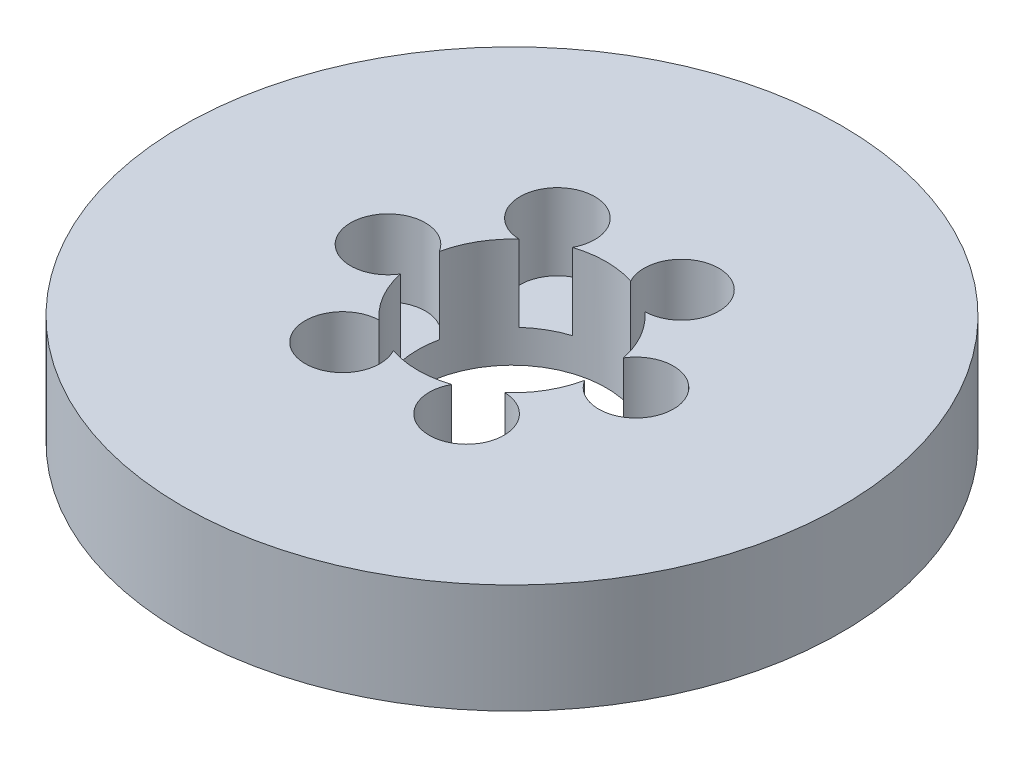
ISO-10303-21;
HEADER;
FILE_DESCRIPTION(('STEP AP214'),'2;1');
FILE_NAME('part.step','',(''),(''),'','','');
FILE_SCHEMA(('AUTOMOTIVE_DESIGN { 1 0 10303 214 1 1 1 1 }'));
ENDSEC;
DATA;
#1=APPLICATION_CONTEXT('core data for automotive mechanical design processes');
#2=APPLICATION_PROTOCOL_DEFINITION('international standard','automotive_design',2000,#1);
#3=PRODUCT_CONTEXT('',#1,'mechanical');
#4=PRODUCT('Part','Part','',(#3));
#5=PRODUCT_RELATED_PRODUCT_CATEGORY('part','',(#4));
#6=PRODUCT_DEFINITION_FORMATION('','',#4);
#7=PRODUCT_DEFINITION_CONTEXT('part definition',#1,'design');
#8=PRODUCT_DEFINITION('design','',#6,#7);
#9=PRODUCT_DEFINITION_SHAPE('','',#8);
#10=(LENGTH_UNIT() NAMED_UNIT(*) SI_UNIT(.MILLI.,.METRE.));
#11=(NAMED_UNIT(*) PLANE_ANGLE_UNIT() SI_UNIT($,.RADIAN.));
#12=(NAMED_UNIT(*) SI_UNIT($,.STERADIAN.) SOLID_ANGLE_UNIT());
#13=UNCERTAINTY_MEASURE_WITH_UNIT(LENGTH_MEASURE(1.E-05),#10,'distance_accuracy_value','');
#14=(GEOMETRIC_REPRESENTATION_CONTEXT(3) GLOBAL_UNCERTAINTY_ASSIGNED_CONTEXT((#13)) GLOBAL_UNIT_ASSIGNED_CONTEXT((#10,
#11,#12)) REPRESENTATION_CONTEXT('',''));
#15=CARTESIAN_POINT('',(0.,0.,0.));
#16=DIRECTION('',(0.,0.,1.));
#17=DIRECTION('',(1.,0.,0.));
#18=AXIS2_PLACEMENT_3D('',#15,#16,#17);
#19=CARTESIAN_POINT('',(0.,29.,0.));
#20=DIRECTION('',(0.,-1.,0.));
#21=DIRECTION('',(0.,0.,-1.));
#22=AXIS2_PLACEMENT_3D('',#19,#20,#21);
#23=CYLINDRICAL_SURFACE('',#22,87.5);
#24=CARTESIAN_POINT('',(0.,29.,0.));
#25=DIRECTION('',(0.,1.,0.));
#26=DIRECTION('',(0.,0.,1.));
#27=AXIS2_PLACEMENT_3D('',#24,#25,#26);
#28=CIRCLE('',#27,87.5);
#29=CARTESIAN_POINT('',(0.,29.,-87.5));
#30=VERTEX_POINT('',#29);
#31=EDGE_CURVE('E171',#30,#30,#28,.T.);
#32=CARTESIAN_POINT('',(0.,0.,0.));
#33=DIRECTION('',(0.,1.,0.));
#34=DIRECTION('',(0.,0.,1.));
#35=AXIS2_PLACEMENT_3D('',#32,#33,#34);
#36=CIRCLE('',#35,87.5);
#37=CARTESIAN_POINT('',(0.,0.,-87.5));
#38=VERTEX_POINT('',#37);
#39=EDGE_CURVE('E157',#38,#38,#36,.T.);
#40=CARTESIAN_POINT('',(0.,29.,-87.5));
#41=CARTESIAN_POINT('',(0.,28.6979166666667,-87.5));
#42=CARTESIAN_POINT('',(0.,28.3958333333333,-87.5));
#43=CARTESIAN_POINT('',(0.,27.7916666666667,-87.5));
#44=CARTESIAN_POINT('',(0.,27.4895833333333,-87.5));
#45=CARTESIAN_POINT('',(0.,26.8854166666667,-87.5));
#46=CARTESIAN_POINT('',(0.,26.5833333333333,-87.5));
#47=CARTESIAN_POINT('',(0.,25.9791666666667,-87.5));
#48=CARTESIAN_POINT('',(0.,25.6770833333333,-87.5));
#49=CARTESIAN_POINT('',(0.,25.0729166666667,-87.5));
#50=CARTESIAN_POINT('',(0.,24.7708333333333,-87.5));
#51=CARTESIAN_POINT('',(0.,24.1666666666667,-87.5));
#52=CARTESIAN_POINT('',(0.,23.8645833333333,-87.5));
#53=CARTESIAN_POINT('',(0.,23.2604166666667,-87.5));
#54=CARTESIAN_POINT('',(0.,22.9583333333333,-87.5));
#55=CARTESIAN_POINT('',(0.,22.3541666666667,-87.5));
#56=CARTESIAN_POINT('',(0.,22.0520833333333,-87.5));
#57=CARTESIAN_POINT('',(0.,21.4479166666667,-87.5));
#58=CARTESIAN_POINT('',(0.,21.1458333333333,-87.5));
#59=CARTESIAN_POINT('',(0.,20.5416666666667,-87.5));
#60=CARTESIAN_POINT('',(0.,20.2395833333333,-87.5));
#61=CARTESIAN_POINT('',(0.,19.6354166666667,-87.5));
#62=CARTESIAN_POINT('',(0.,19.3333333333333,-87.5));
#63=CARTESIAN_POINT('',(0.,18.7291666666667,-87.5));
#64=CARTESIAN_POINT('',(0.,18.4270833333333,-87.5));
#65=CARTESIAN_POINT('',(0.,17.8229166666667,-87.5));
#66=CARTESIAN_POINT('',(0.,17.5208333333333,-87.5));
#67=CARTESIAN_POINT('',(0.,16.9166666666667,-87.5));
#68=CARTESIAN_POINT('',(0.,16.6145833333333,-87.5));
#69=CARTESIAN_POINT('',(0.,16.0104166666667,-87.5));
#70=CARTESIAN_POINT('',(0.,15.7083333333333,-87.5));
#71=CARTESIAN_POINT('',(0.,15.1041666666667,-87.5));
#72=CARTESIAN_POINT('',(0.,14.8020833333333,-87.5));
#73=CARTESIAN_POINT('',(0.,14.1979166666667,-87.5));
#74=CARTESIAN_POINT('',(0.,13.8958333333333,-87.5));
#75=CARTESIAN_POINT('',(0.,13.2916666666667,-87.5));
#76=CARTESIAN_POINT('',(0.,12.9895833333333,-87.5));
#77=CARTESIAN_POINT('',(0.,12.3854166666667,-87.5));
#78=CARTESIAN_POINT('',(0.,12.0833333333333,-87.5));
#79=CARTESIAN_POINT('',(0.,11.4791666666667,-87.5));
#80=CARTESIAN_POINT('',(0.,11.1770833333333,-87.5));
#81=CARTESIAN_POINT('',(0.,10.5729166666667,-87.5));
#82=CARTESIAN_POINT('',(0.,10.2708333333333,-87.5));
#83=CARTESIAN_POINT('',(0.,9.66666666666667,-87.5));
#84=CARTESIAN_POINT('',(0.,9.36458333333333,-87.5));
#85=CARTESIAN_POINT('',(0.,8.76041666666667,-87.5));
#86=CARTESIAN_POINT('',(0.,8.45833333333333,-87.5));
#87=CARTESIAN_POINT('',(0.,7.85416666666667,-87.5));
#88=CARTESIAN_POINT('',(0.,7.55208333333333,-87.5));
#89=CARTESIAN_POINT('',(0.,6.94791666666667,-87.5));
#90=CARTESIAN_POINT('',(0.,6.64583333333333,-87.5));
#91=CARTESIAN_POINT('',(0.,6.04166666666667,-87.5));
#92=CARTESIAN_POINT('',(0.,5.73958333333333,-87.5));
#93=CARTESIAN_POINT('',(0.,5.13541666666667,-87.5));
#94=CARTESIAN_POINT('',(0.,4.83333333333333,-87.5));
#95=CARTESIAN_POINT('',(0.,4.22916666666667,-87.5));
#96=CARTESIAN_POINT('',(0.,3.92708333333333,-87.5));
#97=CARTESIAN_POINT('',(0.,3.32291666666667,-87.5));
#98=CARTESIAN_POINT('',(0.,3.02083333333333,-87.5));
#99=CARTESIAN_POINT('',(0.,2.41666666666667,-87.5));
#100=CARTESIAN_POINT('',(0.,2.11458333333333,-87.5));
#101=CARTESIAN_POINT('',(0.,1.51041666666667,-87.5));
#102=CARTESIAN_POINT('',(0.,1.20833333333333,-87.5));
#103=CARTESIAN_POINT('',(0.,0.604166666666667,-87.5));
#104=CARTESIAN_POINT('',(0.,0.302083333333333,-87.5));
#105=CARTESIAN_POINT('',(0.,0.,-87.5));
#106=B_SPLINE_CURVE_WITH_KNOTS('',3,(#40,#41,#42,#43,#44,#45,#46,#47,#48,#49,#50,#51,#52,#53,
#54,#55,#56,#57,#58,#59,#60,#61,#62,#63,#64,#65,#66,#67,#68,#69,#70,#71,#72,#73,#74,#75,#76,#77,
#78,#79,#80,#81,#82,#83,#84,#85,#86,#87,#88,#89,#90,#91,#92,#93,#94,#95,#96,#97,#98,#99,#100,
#101,#102,#103,#104,#105),.UNSPECIFIED.,.F.,.F.,(4,2,2,2,2,2,2,2,2,2,2,2,2,2,2,2,2,2,2,2,2,2,2,
2,2,2,2,2,2,2,2,2,4),(0.,0.906249999999997,1.8125,2.71875,3.625,4.53125,5.4375,6.34375,7.25,
8.15625,9.0625,9.96875,10.875,11.78125,12.6875,13.59375,14.5,15.40625,16.3125,17.21875,18.125,
19.03125,19.9375,20.84375,21.75,22.65625,23.5625,24.46875,25.375,26.28125,27.1875,28.09375,29.),.UNSPECIFIED.);
#107=EDGE_CURVE('BSEAM39',#30,#38,#106,.T.);
#108=ORIENTED_EDGE('',*,*,#31,.F.);
#109=ORIENTED_EDGE('',*,*,#39,.T.);
#110=ORIENTED_EDGE('',*,*,#107,.T.);
#111=ORIENTED_EDGE('',*,*,#107,.F.);
#112=EDGE_LOOP('',(#108,#110,#109,#111));
#113=FACE_BOUND('',#112,.T.);
#114=ADVANCED_FACE('F39',(#113),#23,.T.);
#115=CARTESIAN_POINT('',(0.,29.,0.));
#116=DIRECTION('',(0.,1.,0.));
#117=DIRECTION('',(0.,0.,1.));
#118=AXIS2_PLACEMENT_3D('',#115,#116,#117);
#119=PLANE('',#118);
#120=CARTESIAN_POINT('',(-16.4652779547785,29.,-28.5186979784194));
#121=DIRECTION('',(0.,1.,0.));
#122=DIRECTION('',(-0.866025403784433,0.,0.50000000000001));
#123=AXIS2_PLACEMENT_3D('',#120,#121,#122);
#124=CIRCLE('',#123,9.92174773075331);
#125=CARTESIAN_POINT('',(-7.75559780643445,29.,-23.7665879474701));
#126=VERTEX_POINT('',#125);
#127=CARTESIAN_POINT('',(-16.7046700205693,29.,-18.5998386956417));
#128=VERTEX_POINT('',#127);
#129=EDGE_CURVE('E214',#126,#128,#124,.T.);
#130=ORIENTED_EDGE('',*,*,#129,.F.);
#131=CARTESIAN_POINT('',(0.,29.,0.));
#132=DIRECTION('',(0.,1.,0.));
#133=DIRECTION('',(0.,0.,1.));
#134=AXIS2_PLACEMENT_3D('',#131,#132,#133);
#135=CIRCLE('',#134,25.);
#136=CARTESIAN_POINT('',(7.75559780643395,29.,-23.7665879474702));
#137=VERTEX_POINT('',#136);
#138=EDGE_CURVE('E272',#137,#126,#135,.T.);
#139=ORIENTED_EDGE('',*,*,#138,.F.);
#140=CARTESIAN_POINT('',(16.4652779547779,29.,-28.5186979784198));
#141=DIRECTION('',(0.,1.,0.));
#142=DIRECTION('',(-0.866025403784443,0.,-0.499999999999992));
#143=AXIS2_PLACEMENT_3D('',#140,#141,#142);
#144=CIRCLE('',#143,9.92174773075331);
#145=CARTESIAN_POINT('',(16.704670020569,29.,-18.5998386956421));
#146=VERTEX_POINT('',#145);
#147=EDGE_CURVE('E285',#146,#137,#144,.T.);
#148=ORIENTED_EDGE('',*,*,#147,.F.);
#149=CARTESIAN_POINT('',(24.4602678270033,29.,-5.16674925182822));
#150=VERTEX_POINT('',#149);
#151=EDGE_CURVE('E165',#150,#146,#135,.T.);
#152=ORIENTED_EDGE('',*,*,#151,.F.);
#153=CARTESIAN_POINT('',(32.9305559095564,29.,0.));
#154=DIRECTION('',(0.,1.,0.));
#155=DIRECTION('',(0.,0.,-1.));
#156=AXIS2_PLACEMENT_3D('',#153,#154,#155);
#157=CIRCLE('',#156,9.92174773075331);
#158=CARTESIAN_POINT('',(24.4602678270033,29.,5.16674925182822));
#159=VERTEX_POINT('',#158);
#160=EDGE_CURVE('E281',#159,#150,#157,.T.);
#161=ORIENTED_EDGE('',*,*,#160,.F.);
#162=CARTESIAN_POINT('',(16.7046700205692,29.,18.5998386956419));
#163=VERTEX_POINT('',#162);
#164=EDGE_CURVE('E160',#163,#159,#135,.T.);
#165=ORIENTED_EDGE('',*,*,#164,.F.);
#166=CARTESIAN_POINT('',(16.4652779547783,29.,28.5186979784195));
#167=DIRECTION('',(0.,1.,0.));
#168=DIRECTION('',(0.866025403784436,0.,-0.500000000000004));
#169=AXIS2_PLACEMENT_3D('',#166,#167,#168);
#170=CIRCLE('',#169,9.92174773075331);
#171=CARTESIAN_POINT('',(7.75559780643429,29.,23.7665879474701));
#172=VERTEX_POINT('',#171);
#173=EDGE_CURVE('E154',#172,#163,#170,.T.);
#174=ORIENTED_EDGE('',*,*,#173,.F.);
#175=CARTESIAN_POINT('',(-7.75559780643412,29.,23.7665879474702));
#176=VERTEX_POINT('',#175);
#177=EDGE_CURVE('E150',#176,#172,#135,.T.);
#178=ORIENTED_EDGE('',*,*,#177,.F.);
#179=CARTESIAN_POINT('',(-16.4652779547781,29.,28.5186979784196));
#180=DIRECTION('',(0.,1.,0.));
#181=DIRECTION('',(0.86602540378444,0.,0.499999999999998));
#182=AXIS2_PLACEMENT_3D('',#179,#180,#181);
#183=CIRCLE('',#182,9.92174773075331);
#184=CARTESIAN_POINT('',(-16.7046700205691,29.,18.599838695642));
#185=VERTEX_POINT('',#184);
#186=EDGE_CURVE('E127',#185,#176,#183,.T.);
#187=ORIENTED_EDGE('',*,*,#186,.F.);
#188=CARTESIAN_POINT('',(-24.4602678270033,29.,5.16674925182822));
#189=VERTEX_POINT('',#188);
#190=EDGE_CURVE('E156',#189,#185,#135,.T.);
#191=ORIENTED_EDGE('',*,*,#190,.F.);
#192=CARTESIAN_POINT('',(-32.9305559095564,29.,0.));
#193=DIRECTION('',(0.,1.,0.));
#194=DIRECTION('',(0.,0.,1.));
#195=AXIS2_PLACEMENT_3D('',#192,#193,#194);
#196=CIRCLE('',#195,9.92174773075331);
#197=CARTESIAN_POINT('',(-24.4602678270033,29.,-5.16674925182822));
#198=VERTEX_POINT('',#197);
#199=EDGE_CURVE('E164',#198,#189,#196,.T.);
#200=ORIENTED_EDGE('',*,*,#199,.F.);
#201=EDGE_CURVE('E159',#128,#198,#135,.T.);
#202=ORIENTED_EDGE('',*,*,#201,.F.);
#203=EDGE_LOOP('',(#130,#139,#148,#152,#161,#165,#174,#178,#187,#191,#200,#202));
#204=FACE_BOUND('',#203,.T.);
#205=ORIENTED_EDGE('',*,*,#31,.T.);
#206=EDGE_LOOP('',(#205));
#207=FACE_BOUND('',#206,.T.);
#208=ADVANCED_FACE('F155',(#204,#207),#119,.T.);
#209=CARTESIAN_POINT('',(0.,0.,0.));
#210=DIRECTION('',(0.,1.,0.));
#211=DIRECTION('',(0.,0.,1.));
#212=AXIS2_PLACEMENT_3D('',#209,#210,#211);
#213=PLANE('',#212);
#214=CARTESIAN_POINT('',(0.,0.,0.));
#215=DIRECTION('',(0.,1.,0.));
#216=DIRECTION('',(0.,0.,1.));
#217=AXIS2_PLACEMENT_3D('',#214,#215,#216);
#218=CIRCLE('',#217,25.);
#219=CARTESIAN_POINT('',(0.,0.,25.));
#220=VERTEX_POINT('',#219);
#221=EDGE_CURVE('E170',#220,#220,#218,.T.);
#222=ORIENTED_EDGE('',*,*,#221,.T.);
#223=EDGE_LOOP('',(#222));
#224=FACE_BOUND('',#223,.T.);
#225=ORIENTED_EDGE('',*,*,#39,.F.);
#226=EDGE_LOOP('',(#225));
#227=FACE_BOUND('',#226,.T.);
#228=ADVANCED_FACE('F232',(#224,#227),#213,.F.);
#229=CARTESIAN_POINT('',(0.,29.,0.));
#230=DIRECTION('',(0.,-1.,0.));
#231=DIRECTION('',(0.,0.,-1.));
#232=AXIS2_PLACEMENT_3D('',#229,#230,#231);
#233=CYLINDRICAL_SURFACE('',#232,25.);
#234=DIRECTION('',(0.,1.,0.));
#235=VECTOR('',#234,1.);
#236=CARTESIAN_POINT('',(-7.75559780643445,18.8636878247054,-23.7665879474701));
#237=LINE('',#236,#235);
#238=CARTESIAN_POINT('',(-7.75559780643445,8.72737564941077,-23.7665879474701));
#239=VERTEX_POINT('',#238);
#240=EDGE_CURVE('E11',#239,#126,#237,.T.);
#241=ORIENTED_EDGE('',*,*,#240,.F.);
#242=CARTESIAN_POINT('',(0.,8.72737564941077,0.));
#243=DIRECTION('',(0.,1.,0.));
#244=DIRECTION('',(0.,0.,1.));
#245=AXIS2_PLACEMENT_3D('',#242,#243,#244);
#246=CIRCLE('',#245,25.);
#247=CARTESIAN_POINT('',(-16.7046700205693,8.72737564941077,-18.5998386956417));
#248=VERTEX_POINT('',#247);
#249=EDGE_CURVE('E209',#239,#248,#246,.T.);
#250=ORIENTED_EDGE('',*,*,#249,.T.);
#251=DIRECTION('',(0.,1.,0.));
#252=VECTOR('',#251,1.);
#253=CARTESIAN_POINT('',(-16.7046700205693,18.8636878247054,-18.5998386956417));
#254=LINE('',#253,#252);
#255=EDGE_CURVE('E46',#128,#248,#254,.F.);
#256=ORIENTED_EDGE('',*,*,#255,.F.);
#257=ORIENTED_EDGE('',*,*,#201,.T.);
#258=DIRECTION('',(0.,1.,0.));
#259=VECTOR('',#258,1.);
#260=CARTESIAN_POINT('',(-24.4602678270033,18.8636878247054,-5.16674925182822));
#261=LINE('',#260,#259);
#262=CARTESIAN_POINT('',(-24.4602678270033,8.72737564941077,-5.16674925182822));
#263=VERTEX_POINT('',#262);
#264=EDGE_CURVE('E185',#263,#198,#261,.T.);
#265=ORIENTED_EDGE('',*,*,#264,.F.);
#266=CARTESIAN_POINT('',(0.,8.72737564941077,0.));
#267=DIRECTION('',(0.,1.,0.));
#268=DIRECTION('',(0.,0.,1.));
#269=AXIS2_PLACEMENT_3D('',#266,#267,#268);
#270=CIRCLE('',#269,25.);
#271=CARTESIAN_POINT('',(-24.4602678270033,8.72737564941077,5.16674925182822));
#272=VERTEX_POINT('',#271);
#273=EDGE_CURVE('E173',#263,#272,#270,.T.);
#274=ORIENTED_EDGE('',*,*,#273,.T.);
#275=DIRECTION('',(0.,1.,0.));
#276=VECTOR('',#275,1.);
#277=CARTESIAN_POINT('',(-24.4602678270033,18.8636878247054,5.16674925182822));
#278=LINE('',#277,#276);
#279=EDGE_CURVE('E178',#189,#272,#278,.F.);
#280=ORIENTED_EDGE('',*,*,#279,.F.);
#281=ORIENTED_EDGE('',*,*,#190,.T.);
#282=DIRECTION('',(0.,1.,0.));
#283=VECTOR('',#282,1.);
#284=CARTESIAN_POINT('',(-16.7046700205691,18.8636878247054,18.599838695642));
#285=LINE('',#284,#283);
#286=CARTESIAN_POINT('',(-16.7046700205691,8.72737564941077,18.599838695642));
#287=VERTEX_POINT('',#286);
#288=EDGE_CURVE('E132',#287,#185,#285,.T.);
#289=ORIENTED_EDGE('',*,*,#288,.F.);
#290=CARTESIAN_POINT('',(0.,8.72737564941077,0.));
#291=DIRECTION('',(0.,1.,0.));
#292=DIRECTION('',(0.,0.,1.));
#293=AXIS2_PLACEMENT_3D('',#290,#291,#292);
#294=CIRCLE('',#293,25.);
#295=CARTESIAN_POINT('',(-7.75559780643412,8.72737564941077,23.7665879474702));
#296=VERTEX_POINT('',#295);
#297=EDGE_CURVE('E146',#287,#296,#294,.T.);
#298=ORIENTED_EDGE('',*,*,#297,.T.);
#299=DIRECTION('',(0.,1.,0.));
#300=VECTOR('',#299,1.);
#301=CARTESIAN_POINT('',(-7.75559780643412,18.8636878247054,23.7665879474702));
#302=LINE('',#301,#300);
#303=EDGE_CURVE('E128',#176,#296,#302,.F.);
#304=ORIENTED_EDGE('',*,*,#303,.F.);
#305=ORIENTED_EDGE('',*,*,#177,.T.);
#306=DIRECTION('',(0.,1.,0.));
#307=VECTOR('',#306,1.);
#308=CARTESIAN_POINT('',(7.75559780643429,18.8636878247054,23.7665879474701));
#309=LINE('',#308,#307);
#310=CARTESIAN_POINT('',(7.75559780643429,8.72737564941077,23.7665879474701));
#311=VERTEX_POINT('',#310);
#312=EDGE_CURVE('E192',#311,#172,#309,.T.);
#313=ORIENTED_EDGE('',*,*,#312,.F.);
#314=CARTESIAN_POINT('',(0.,8.72737564941077,0.));
#315=DIRECTION('',(0.,1.,0.));
#316=DIRECTION('',(0.,0.,1.));
#317=AXIS2_PLACEMENT_3D('',#314,#315,#316);
#318=CIRCLE('',#317,25.);
#319=CARTESIAN_POINT('',(16.7046700205692,8.72737564941077,18.5998386956419));
#320=VERTEX_POINT('',#319);
#321=EDGE_CURVE('E190',#311,#320,#318,.T.);
#322=ORIENTED_EDGE('',*,*,#321,.T.);
#323=DIRECTION('',(0.,1.,0.));
#324=VECTOR('',#323,1.);
#325=CARTESIAN_POINT('',(16.7046700205692,18.8636878247054,18.5998386956419));
#326=LINE('',#325,#324);
#327=EDGE_CURVE('E189',#163,#320,#326,.F.);
#328=ORIENTED_EDGE('',*,*,#327,.F.);
#329=ORIENTED_EDGE('',*,*,#164,.T.);
#330=DIRECTION('',(0.,1.,0.));
#331=VECTOR('',#330,1.);
#332=CARTESIAN_POINT('',(24.4602678270033,18.8636878247054,5.16674925182822));
#333=LINE('',#332,#331);
#334=CARTESIAN_POINT('',(24.4602678270033,8.72737564941077,5.16674925182822));
#335=VERTEX_POINT('',#334);
#336=EDGE_CURVE('E203',#335,#159,#333,.T.);
#337=ORIENTED_EDGE('',*,*,#336,.F.);
#338=CARTESIAN_POINT('',(0.,8.72737564941077,0.));
#339=DIRECTION('',(0.,1.,0.));
#340=DIRECTION('',(0.,0.,1.));
#341=AXIS2_PLACEMENT_3D('',#338,#339,#340);
#342=CIRCLE('',#341,25.);
#343=CARTESIAN_POINT('',(24.4602678270033,8.72737564941077,-5.16674925182822));
#344=VERTEX_POINT('',#343);
#345=EDGE_CURVE('E194',#335,#344,#342,.T.);
#346=ORIENTED_EDGE('',*,*,#345,.T.);
#347=DIRECTION('',(0.,1.,0.));
#348=VECTOR('',#347,1.);
#349=CARTESIAN_POINT('',(24.4602678270033,18.8636878247054,-5.16674925182822));
#350=LINE('',#349,#348);
#351=EDGE_CURVE('E196',#150,#344,#350,.F.);
#352=ORIENTED_EDGE('',*,*,#351,.F.);
#353=ORIENTED_EDGE('',*,*,#151,.T.);
#354=DIRECTION('',(0.,1.,0.));
#355=VECTOR('',#354,1.);
#356=CARTESIAN_POINT('',(16.704670020569,18.8636878247054,-18.5998386956421));
#357=LINE('',#356,#355);
#358=CARTESIAN_POINT('',(16.704670020569,8.72737564941077,-18.5998386956421));
#359=VERTEX_POINT('',#358);
#360=EDGE_CURVE('E208',#359,#146,#357,.T.);
#361=ORIENTED_EDGE('',*,*,#360,.F.);
#362=CARTESIAN_POINT('',(0.,8.72737564941077,0.));
#363=DIRECTION('',(0.,1.,0.));
#364=DIRECTION('',(0.,0.,1.));
#365=AXIS2_PLACEMENT_3D('',#362,#363,#364);
#366=CIRCLE('',#365,25.);
#367=CARTESIAN_POINT('',(7.75559780643395,8.72737564941077,-23.7665879474702));
#368=VERTEX_POINT('',#367);
#369=EDGE_CURVE('E201',#359,#368,#366,.T.);
#370=ORIENTED_EDGE('',*,*,#369,.T.);
#371=DIRECTION('',(0.,1.,0.));
#372=VECTOR('',#371,1.);
#373=CARTESIAN_POINT('',(7.75559780643395,18.8636878247054,-23.7665879474702));
#374=LINE('',#373,#372);
#375=EDGE_CURVE('E206',#137,#368,#374,.F.);
#376=ORIENTED_EDGE('',*,*,#375,.F.);
#377=ORIENTED_EDGE('',*,*,#138,.T.);
#378=EDGE_LOOP('',(#241,#250,#256,#257,#265,#274,#280,#281,#289,#298,#304,#305,#313,#322,#328,
#329,#337,#346,#352,#353,#361,#370,#376,#377));
#379=FACE_BOUND('',#378,.T.);
#380=ORIENTED_EDGE('',*,*,#221,.F.);
#381=EDGE_LOOP('',(#380));
#382=FACE_BOUND('',#381,.T.);
#383=ADVANCED_FACE('F145',(#379,#382),#233,.F.);
#384=CARTESIAN_POINT('',(-32.9305559095564,8.72737564941077,0.));
#385=DIRECTION('',(0.,1.,0.));
#386=DIRECTION('',(0.,0.,1.));
#387=AXIS2_PLACEMENT_3D('',#384,#385,#386);
#388=CYLINDRICAL_SURFACE('',#387,9.92174773075331);
#389=ORIENTED_EDGE('',*,*,#264,.T.);
#390=ORIENTED_EDGE('',*,*,#199,.T.);
#391=ORIENTED_EDGE('',*,*,#279,.T.);
#392=CARTESIAN_POINT('',(-32.9305559095564,8.72737564941077,0.));
#393=DIRECTION('',(0.,1.,0.));
#394=DIRECTION('',(0.,0.,1.));
#395=AXIS2_PLACEMENT_3D('',#392,#393,#394);
#396=CIRCLE('',#395,9.92174773075331);
#397=EDGE_CURVE('E168',#263,#272,#396,.T.);
#398=ORIENTED_EDGE('',*,*,#397,.F.);
#399=EDGE_LOOP('',(#389,#390,#391,#398));
#400=FACE_BOUND('',#399,.T.);
#401=ADVANCED_FACE('F243',(#400),#388,.F.);
#402=CARTESIAN_POINT('',(-32.9305559095564,8.72737564941077,0.));
#403=DIRECTION('',(0.,1.,0.));
#404=DIRECTION('',(0.,0.,1.));
#405=AXIS2_PLACEMENT_3D('',#402,#403,#404);
#406=PLANE('',#405);
#407=ORIENTED_EDGE('',*,*,#397,.T.);
#408=ORIENTED_EDGE('',*,*,#273,.F.);
#409=EDGE_LOOP('',(#407,#408));
#410=FACE_BOUND('',#409,.T.);
#411=ADVANCED_FACE('F247',(#410),#406,.T.);
#412=CARTESIAN_POINT('',(-16.4652779547781,8.72737564941077,28.5186979784196));
#413=DIRECTION('',(0.,1.,0.));
#414=DIRECTION('',(0.,0.,1.));
#415=AXIS2_PLACEMENT_3D('',#412,#413,#414);
#416=CYLINDRICAL_SURFACE('',#415,9.92174773075331);
#417=ORIENTED_EDGE('',*,*,#288,.T.);
#418=ORIENTED_EDGE('',*,*,#186,.T.);
#419=ORIENTED_EDGE('',*,*,#303,.T.);
#420=CARTESIAN_POINT('',(-16.4652779547781,8.72737564941077,28.5186979784196));
#421=DIRECTION('',(0.,1.,0.));
#422=DIRECTION('',(0.86602540378444,0.,0.499999999999998));
#423=AXIS2_PLACEMENT_3D('',#420,#421,#422);
#424=CIRCLE('',#423,9.92174773075331);
#425=EDGE_CURVE('E137',#287,#296,#424,.T.);
#426=ORIENTED_EDGE('',*,*,#425,.F.);
#427=EDGE_LOOP('',(#417,#418,#419,#426));
#428=FACE_BOUND('',#427,.T.);
#429=ADVANCED_FACE('F126',(#428),#416,.F.);
#430=CARTESIAN_POINT('',(-16.4652779547781,8.72737564941077,28.5186979784196));
#431=DIRECTION('',(0.,1.,0.));
#432=DIRECTION('',(0.86602540378444,0.,0.499999999999998));
#433=AXIS2_PLACEMENT_3D('',#430,#431,#432);
#434=PLANE('',#433);
#435=ORIENTED_EDGE('',*,*,#425,.T.);
#436=ORIENTED_EDGE('',*,*,#297,.F.);
#437=EDGE_LOOP('',(#435,#436));
#438=FACE_BOUND('',#437,.T.);
#439=ADVANCED_FACE('F254',(#438),#434,.T.);
#440=CARTESIAN_POINT('',(16.4652779547783,8.72737564941077,28.5186979784195));
#441=DIRECTION('',(0.,1.,0.));
#442=DIRECTION('',(0.,0.,1.));
#443=AXIS2_PLACEMENT_3D('',#440,#441,#442);
#444=CYLINDRICAL_SURFACE('',#443,9.92174773075331);
#445=ORIENTED_EDGE('',*,*,#312,.T.);
#446=ORIENTED_EDGE('',*,*,#173,.T.);
#447=ORIENTED_EDGE('',*,*,#327,.T.);
#448=CARTESIAN_POINT('',(16.4652779547783,8.72737564941077,28.5186979784195));
#449=DIRECTION('',(0.,1.,0.));
#450=DIRECTION('',(0.866025403784436,0.,-0.500000000000004));
#451=AXIS2_PLACEMENT_3D('',#448,#449,#450);
#452=CIRCLE('',#451,9.92174773075331);
#453=EDGE_CURVE('E138',#311,#320,#452,.T.);
#454=ORIENTED_EDGE('',*,*,#453,.F.);
#455=EDGE_LOOP('',(#445,#446,#447,#454));
#456=FACE_BOUND('',#455,.T.);
#457=ADVANCED_FACE('F260',(#456),#444,.F.);
#458=CARTESIAN_POINT('',(16.4652779547783,8.72737564941077,28.5186979784195));
#459=DIRECTION('',(0.,1.,0.));
#460=DIRECTION('',(0.866025403784436,0.,-0.500000000000004));
#461=AXIS2_PLACEMENT_3D('',#458,#459,#460);
#462=PLANE('',#461);
#463=ORIENTED_EDGE('',*,*,#453,.T.);
#464=ORIENTED_EDGE('',*,*,#321,.F.);
#465=EDGE_LOOP('',(#463,#464));
#466=FACE_BOUND('',#465,.T.);
#467=ADVANCED_FACE('F265',(#466),#462,.T.);
#468=CARTESIAN_POINT('',(32.9305559095564,8.72737564941077,0.));
#469=DIRECTION('',(0.,1.,0.));
#470=DIRECTION('',(0.,0.,1.));
#471=AXIS2_PLACEMENT_3D('',#468,#469,#470);
#472=CYLINDRICAL_SURFACE('',#471,9.92174773075331);
#473=ORIENTED_EDGE('',*,*,#336,.T.);
#474=ORIENTED_EDGE('',*,*,#160,.T.);
#475=ORIENTED_EDGE('',*,*,#351,.T.);
#476=CARTESIAN_POINT('',(32.9305559095564,8.72737564941077,0.));
#477=DIRECTION('',(0.,1.,0.));
#478=DIRECTION('',(0.,0.,-1.));
#479=AXIS2_PLACEMENT_3D('',#476,#477,#478);
#480=CIRCLE('',#479,9.92174773075331);
#481=EDGE_CURVE('E287',#335,#344,#480,.T.);
#482=ORIENTED_EDGE('',*,*,#481,.F.);
#483=EDGE_LOOP('',(#473,#474,#475,#482));
#484=FACE_BOUND('',#483,.T.);
#485=ADVANCED_FACE('F300',(#484),#472,.F.);
#486=CARTESIAN_POINT('',(32.9305559095564,8.72737564941077,0.));
#487=DIRECTION('',(0.,1.,0.));
#488=DIRECTION('',(0.,0.,-1.));
#489=AXIS2_PLACEMENT_3D('',#486,#487,#488);
#490=PLANE('',#489);
#491=ORIENTED_EDGE('',*,*,#481,.T.);
#492=ORIENTED_EDGE('',*,*,#345,.F.);
#493=EDGE_LOOP('',(#491,#492));
#494=FACE_BOUND('',#493,.T.);
#495=ADVANCED_FACE('F298',(#494),#490,.T.);
#496=CARTESIAN_POINT('',(16.4652779547779,8.72737564941077,-28.5186979784198));
#497=DIRECTION('',(0.,1.,0.));
#498=DIRECTION('',(0.,0.,1.));
#499=AXIS2_PLACEMENT_3D('',#496,#497,#498);
#500=CYLINDRICAL_SURFACE('',#499,9.92174773075331);
#501=ORIENTED_EDGE('',*,*,#360,.T.);
#502=ORIENTED_EDGE('',*,*,#147,.T.);
#503=ORIENTED_EDGE('',*,*,#375,.T.);
#504=CARTESIAN_POINT('',(16.4652779547779,8.72737564941077,-28.5186979784198));
#505=DIRECTION('',(0.,1.,0.));
#506=DIRECTION('',(-0.866025403784443,0.,-0.499999999999992));
#507=AXIS2_PLACEMENT_3D('',#504,#505,#506);
#508=CIRCLE('',#507,9.92174773075331);
#509=EDGE_CURVE('E56',#359,#368,#508,.T.);
#510=ORIENTED_EDGE('',*,*,#509,.F.);
#511=EDGE_LOOP('',(#501,#502,#503,#510));
#512=FACE_BOUND('',#511,.T.);
#513=ADVANCED_FACE('F301',(#512),#500,.F.);
#514=CARTESIAN_POINT('',(16.4652779547779,8.72737564941077,-28.5186979784198));
#515=DIRECTION('',(0.,1.,0.));
#516=DIRECTION('',(-0.866025403784443,0.,-0.499999999999992));
#517=AXIS2_PLACEMENT_3D('',#514,#515,#516);
#518=PLANE('',#517);
#519=ORIENTED_EDGE('',*,*,#509,.T.);
#520=ORIENTED_EDGE('',*,*,#369,.F.);
#521=EDGE_LOOP('',(#519,#520));
#522=FACE_BOUND('',#521,.T.);
#523=ADVANCED_FACE('F221',(#522),#518,.T.);
#524=CARTESIAN_POINT('',(-16.4652779547785,8.72737564941077,-28.5186979784194));
#525=DIRECTION('',(0.,1.,0.));
#526=DIRECTION('',(0.,0.,1.));
#527=AXIS2_PLACEMENT_3D('',#524,#525,#526);
#528=CYLINDRICAL_SURFACE('',#527,9.92174773075331);
#529=ORIENTED_EDGE('',*,*,#240,.T.);
#530=ORIENTED_EDGE('',*,*,#129,.T.);
#531=ORIENTED_EDGE('',*,*,#255,.T.);
#532=CARTESIAN_POINT('',(-16.4652779547785,8.72737564941077,-28.5186979784194));
#533=DIRECTION('',(0.,1.,0.));
#534=DIRECTION('',(-0.866025403784433,0.,0.50000000000001));
#535=AXIS2_PLACEMENT_3D('',#532,#533,#534);
#536=CIRCLE('',#535,9.92174773075331);
#537=EDGE_CURVE('E55',#239,#248,#536,.T.);
#538=ORIENTED_EDGE('',*,*,#537,.F.);
#539=EDGE_LOOP('',(#529,#530,#531,#538));
#540=FACE_BOUND('',#539,.T.);
#541=ADVANCED_FACE('F212',(#540),#528,.F.);
#542=CARTESIAN_POINT('',(-16.4652779547785,8.72737564941077,-28.5186979784194));
#543=DIRECTION('',(0.,1.,0.));
#544=DIRECTION('',(-0.866025403784433,0.,0.50000000000001));
#545=AXIS2_PLACEMENT_3D('',#542,#543,#544);
#546=PLANE('',#545);
#547=ORIENTED_EDGE('',*,*,#537,.T.);
#548=ORIENTED_EDGE('',*,*,#249,.F.);
#549=EDGE_LOOP('',(#547,#548));
#550=FACE_BOUND('',#549,.T.);
#551=ADVANCED_FACE('F217',(#550),#546,.T.);
#552=CLOSED_SHELL('',(#114,#208,#228,#383,#401,#411,#429,#439,#457,#467,#485,#495,#513,#523,
#541,#551));
#553=MANIFOLD_SOLID_BREP('B2',#552);
#554=ADVANCED_BREP_SHAPE_REPRESENTATION('',(#18,#553),#14);
#555=SHAPE_DEFINITION_REPRESENTATION(#9,#554);
ENDSEC;
END-ISO-10303-21;
